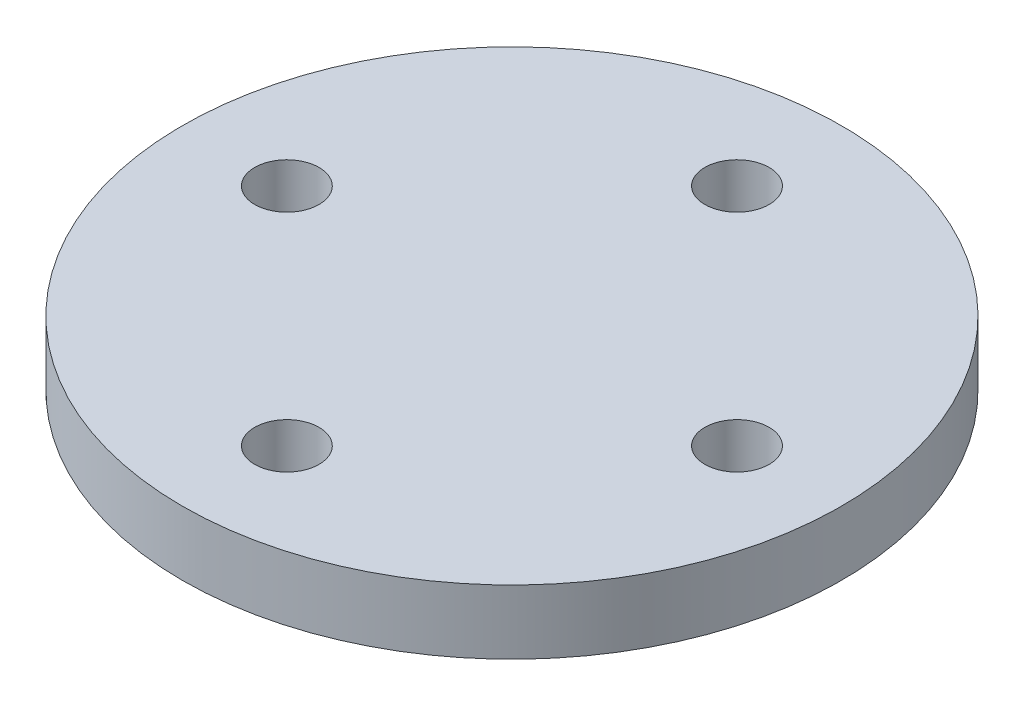
ISO-10303-21;
HEADER;
FILE_DESCRIPTION(('STEP AP214'),'2;1');
FILE_NAME('part.step','',(''),(''),'','','');
FILE_SCHEMA(('AUTOMOTIVE_DESIGN { 1 0 10303 214 1 1 1 1 }'));
ENDSEC;
DATA;
#1=APPLICATION_CONTEXT('core data for automotive mechanical design processes');
#2=APPLICATION_PROTOCOL_DEFINITION('international standard','automotive_design',2000,#1);
#3=PRODUCT_CONTEXT('',#1,'mechanical');
#4=PRODUCT('Part','Part','',(#3));
#5=PRODUCT_RELATED_PRODUCT_CATEGORY('part','',(#4));
#6=PRODUCT_DEFINITION_FORMATION('','',#4);
#7=PRODUCT_DEFINITION_CONTEXT('part definition',#1,'design');
#8=PRODUCT_DEFINITION('design','',#6,#7);
#9=PRODUCT_DEFINITION_SHAPE('','',#8);
#10=(LENGTH_UNIT() NAMED_UNIT(*) SI_UNIT(.MILLI.,.METRE.));
#11=(NAMED_UNIT(*) PLANE_ANGLE_UNIT() SI_UNIT($,.RADIAN.));
#12=(NAMED_UNIT(*) SI_UNIT($,.STERADIAN.) SOLID_ANGLE_UNIT());
#13=UNCERTAINTY_MEASURE_WITH_UNIT(LENGTH_MEASURE(1.E-05),#10,'distance_accuracy_value','');
#14=(GEOMETRIC_REPRESENTATION_CONTEXT(3) GLOBAL_UNCERTAINTY_ASSIGNED_CONTEXT((#13)) GLOBAL_UNIT_ASSIGNED_CONTEXT((#10,
#11,#12)) REPRESENTATION_CONTEXT('',''));
#15=CARTESIAN_POINT('',(0.,0.,0.));
#16=DIRECTION('',(0.,0.,1.));
#17=DIRECTION('',(1.,0.,0.));
#18=AXIS2_PLACEMENT_3D('',#15,#16,#17);
#19=CARTESIAN_POINT('',(0.,2.,0.));
#20=DIRECTION('',(0.,-1.,0.));
#21=DIRECTION('',(0.,0.,-1.));
#22=AXIS2_PLACEMENT_3D('',#19,#20,#21);
#23=CYLINDRICAL_SURFACE('',#22,10.25);
#24=CARTESIAN_POINT('',(0.,2.,0.));
#25=DIRECTION('',(0.,1.,0.));
#26=DIRECTION('',(0.,0.,1.));
#27=AXIS2_PLACEMENT_3D('',#24,#25,#26);
#28=CIRCLE('',#27,10.25);
#29=CARTESIAN_POINT('',(0.,2.,10.25));
#30=VERTEX_POINT('',#29);
#31=EDGE_CURVE('E41',#30,#30,#28,.T.);
#32=ORIENTED_EDGE('',*,*,#31,.F.);
#33=EDGE_LOOP('',(#32));
#34=FACE_BOUND('',#33,.T.);
#35=CARTESIAN_POINT('',(0.,0.,0.));
#36=DIRECTION('',(0.,1.,0.));
#37=DIRECTION('',(0.,0.,1.));
#38=AXIS2_PLACEMENT_3D('',#35,#36,#37);
#39=CIRCLE('',#38,10.25);
#40=CARTESIAN_POINT('',(0.,0.,10.25));
#41=VERTEX_POINT('',#40);
#42=EDGE_CURVE('E46',#41,#41,#39,.T.);
#43=ORIENTED_EDGE('',*,*,#42,.T.);
#44=EDGE_LOOP('',(#43));
#45=FACE_BOUND('',#44,.T.);
#46=ADVANCED_FACE('F34',(#34,#45),#23,.T.);
#47=CARTESIAN_POINT('',(0.,2.,0.));
#48=DIRECTION('',(0.,1.,0.));
#49=DIRECTION('',(0.,0.,1.));
#50=AXIS2_PLACEMENT_3D('',#47,#48,#49);
#51=PLANE('',#50);
#52=CARTESIAN_POINT('',(-7.,2.,0.));
#53=DIRECTION('',(0.,1.,0.));
#54=DIRECTION('',(0.,0.,1.));
#55=AXIS2_PLACEMENT_3D('',#52,#53,#54);
#56=CIRCLE('',#55,1.);
#57=CARTESIAN_POINT('',(-7.,2.,1.));
#58=VERTEX_POINT('',#57);
#59=EDGE_CURVE('E54',#58,#58,#56,.T.);
#60=ORIENTED_EDGE('',*,*,#59,.F.);
#61=EDGE_LOOP('',(#60));
#62=FACE_BOUND('',#61,.T.);
#63=CARTESIAN_POINT('',(0.,2.,-7.));
#64=DIRECTION('',(0.,1.,0.));
#65=DIRECTION('',(0.,0.,1.));
#66=AXIS2_PLACEMENT_3D('',#63,#64,#65);
#67=CIRCLE('',#66,1.);
#68=CARTESIAN_POINT('',(0.,2.,-6.));
#69=VERTEX_POINT('',#68);
#70=EDGE_CURVE('E81',#69,#69,#67,.T.);
#71=ORIENTED_EDGE('',*,*,#70,.F.);
#72=EDGE_LOOP('',(#71));
#73=FACE_BOUND('',#72,.T.);
#74=CARTESIAN_POINT('',(7.,2.,0.));
#75=DIRECTION('',(0.,1.,0.));
#76=DIRECTION('',(0.,0.,1.));
#77=AXIS2_PLACEMENT_3D('',#74,#75,#76);
#78=CIRCLE('',#77,1.);
#79=CARTESIAN_POINT('',(7.,2.,1.));
#80=VERTEX_POINT('',#79);
#81=EDGE_CURVE('E78',#80,#80,#78,.T.);
#82=ORIENTED_EDGE('',*,*,#81,.F.);
#83=EDGE_LOOP('',(#82));
#84=FACE_BOUND('',#83,.T.);
#85=CARTESIAN_POINT('',(0.,2.,7.));
#86=DIRECTION('',(0.,1.,0.));
#87=DIRECTION('',(0.,0.,1.));
#88=AXIS2_PLACEMENT_3D('',#85,#86,#87);
#89=CIRCLE('',#88,1.);
#90=CARTESIAN_POINT('',(0.,2.,8.));
#91=VERTEX_POINT('',#90);
#92=EDGE_CURVE('E75',#91,#91,#89,.T.);
#93=ORIENTED_EDGE('',*,*,#92,.F.);
#94=EDGE_LOOP('',(#93));
#95=FACE_BOUND('',#94,.T.);
#96=ORIENTED_EDGE('',*,*,#31,.T.);
#97=EDGE_LOOP('',(#96));
#98=FACE_BOUND('',#97,.T.);
#99=ADVANCED_FACE('F90',(#62,#73,#84,#95,#98),#51,.T.);
#100=CARTESIAN_POINT('',(0.,0.,0.));
#101=DIRECTION('',(0.,1.,0.));
#102=DIRECTION('',(0.,0.,1.));
#103=AXIS2_PLACEMENT_3D('',#100,#101,#102);
#104=PLANE('',#103);
#105=CARTESIAN_POINT('',(-7.,0.,0.));
#106=DIRECTION('',(0.,1.,0.));
#107=DIRECTION('',(0.,0.,1.));
#108=AXIS2_PLACEMENT_3D('',#105,#106,#107);
#109=CIRCLE('',#108,1.);
#110=CARTESIAN_POINT('',(-7.,0.,1.));
#111=VERTEX_POINT('',#110);
#112=EDGE_CURVE('E37',#111,#111,#109,.T.);
#113=ORIENTED_EDGE('',*,*,#112,.T.);
#114=EDGE_LOOP('',(#113));
#115=FACE_BOUND('',#114,.T.);
#116=CARTESIAN_POINT('',(0.,0.,-7.));
#117=DIRECTION('',(0.,1.,0.));
#118=DIRECTION('',(0.,0.,1.));
#119=AXIS2_PLACEMENT_3D('',#116,#117,#118);
#120=CIRCLE('',#119,1.);
#121=CARTESIAN_POINT('',(0.,0.,-6.));
#122=VERTEX_POINT('',#121);
#123=EDGE_CURVE('E56',#122,#122,#120,.T.);
#124=ORIENTED_EDGE('',*,*,#123,.T.);
#125=EDGE_LOOP('',(#124));
#126=FACE_BOUND('',#125,.T.);
#127=CARTESIAN_POINT('',(7.,0.,0.));
#128=DIRECTION('',(0.,1.,0.));
#129=DIRECTION('',(0.,0.,1.));
#130=AXIS2_PLACEMENT_3D('',#127,#128,#129);
#131=CIRCLE('',#130,1.);
#132=CARTESIAN_POINT('',(7.,0.,1.));
#133=VERTEX_POINT('',#132);
#134=EDGE_CURVE('E53',#133,#133,#131,.T.);
#135=ORIENTED_EDGE('',*,*,#134,.T.);
#136=EDGE_LOOP('',(#135));
#137=FACE_BOUND('',#136,.T.);
#138=CARTESIAN_POINT('',(0.,0.,7.));
#139=DIRECTION('',(0.,1.,0.));
#140=DIRECTION('',(0.,0.,1.));
#141=AXIS2_PLACEMENT_3D('',#138,#139,#140);
#142=CIRCLE('',#141,1.);
#143=CARTESIAN_POINT('',(0.,0.,8.));
#144=VERTEX_POINT('',#143);
#145=EDGE_CURVE('E50',#144,#144,#142,.T.);
#146=ORIENTED_EDGE('',*,*,#145,.T.);
#147=EDGE_LOOP('',(#146));
#148=FACE_BOUND('',#147,.T.);
#149=CARTESIAN_POINT('',(0.,0.,0.));
#150=DIRECTION('',(0.,1.,0.));
#151=DIRECTION('',(0.,0.,1.));
#152=AXIS2_PLACEMENT_3D('',#149,#150,#151);
#153=CIRCLE('',#152,4.);
#154=CARTESIAN_POINT('',(0.,0.,4.));
#155=VERTEX_POINT('',#154);
#156=EDGE_CURVE('E10',#155,#155,#153,.F.);
#157=ORIENTED_EDGE('',*,*,#156,.F.);
#158=EDGE_LOOP('',(#157));
#159=FACE_BOUND('',#158,.T.);
#160=ORIENTED_EDGE('',*,*,#42,.F.);
#161=EDGE_LOOP('',(#160));
#162=FACE_BOUND('',#161,.T.);
#163=ADVANCED_FACE('F93',(#115,#126,#137,#148,#159,#162),#104,.F.);
#164=CARTESIAN_POINT('',(0.,-3.,0.));
#165=DIRECTION('',(0.,1.,0.));
#166=DIRECTION('',(0.,0.,1.));
#167=AXIS2_PLACEMENT_3D('',#164,#165,#166);
#168=CYLINDRICAL_SURFACE('',#167,3.);
#169=CARTESIAN_POINT('',(0.,-3.,0.));
#170=DIRECTION('',(0.,-1.,0.));
#171=DIRECTION('',(0.,0.,-1.));
#172=AXIS2_PLACEMENT_3D('',#169,#170,#171);
#173=CIRCLE('',#172,3.);
#174=CARTESIAN_POINT('',(0.,-3.,-3.));
#175=VERTEX_POINT('',#174);
#176=EDGE_CURVE('E65',#175,#175,#173,.T.);
#177=ORIENTED_EDGE('',*,*,#176,.T.);
#178=EDGE_LOOP('',(#177));
#179=FACE_BOUND('',#178,.T.);
#180=CARTESIAN_POINT('',(0.,0.,0.));
#181=DIRECTION('',(0.,-1.,0.));
#182=DIRECTION('',(0.,0.,-1.));
#183=AXIS2_PLACEMENT_3D('',#180,#181,#182);
#184=CIRCLE('',#183,3.);
#185=CARTESIAN_POINT('',(0.,0.,-3.));
#186=VERTEX_POINT('',#185);
#187=EDGE_CURVE('E61',#186,#186,#184,.T.);
#188=ORIENTED_EDGE('',*,*,#187,.F.);
#189=EDGE_LOOP('',(#188));
#190=FACE_BOUND('',#189,.T.);
#191=ADVANCED_FACE('F109',(#179,#190),#168,.F.);
#192=CARTESIAN_POINT('',(0.,-3.,0.));
#193=DIRECTION('',(0.,1.,0.));
#194=DIRECTION('',(0.,0.,1.));
#195=AXIS2_PLACEMENT_3D('',#192,#193,#194);
#196=CYLINDRICAL_SURFACE('',#195,4.);
#197=CARTESIAN_POINT('',(0.,-3.,0.));
#198=DIRECTION('',(0.,-1.,0.));
#199=DIRECTION('',(0.,0.,-1.));
#200=AXIS2_PLACEMENT_3D('',#197,#198,#199);
#201=CIRCLE('',#200,4.);
#202=CARTESIAN_POINT('',(0.,-3.,-4.));
#203=VERTEX_POINT('',#202);
#204=EDGE_CURVE('E70',#203,#203,#201,.T.);
#205=ORIENTED_EDGE('',*,*,#204,.F.);
#206=EDGE_LOOP('',(#205));
#207=FACE_BOUND('',#206,.T.);
#208=ORIENTED_EDGE('',*,*,#156,.T.);
#209=EDGE_LOOP('',(#208));
#210=FACE_BOUND('',#209,.T.);
#211=ADVANCED_FACE('F114',(#207,#210),#196,.T.);
#212=CARTESIAN_POINT('',(0.,-3.,0.));
#213=DIRECTION('',(0.,-1.,0.));
#214=DIRECTION('',(0.,0.,-1.));
#215=AXIS2_PLACEMENT_3D('',#212,#213,#214);
#216=PLANE('',#215);
#217=ORIENTED_EDGE('',*,*,#176,.F.);
#218=EDGE_LOOP('',(#217));
#219=FACE_BOUND('',#218,.T.);
#220=ORIENTED_EDGE('',*,*,#204,.T.);
#221=EDGE_LOOP('',(#220));
#222=FACE_BOUND('',#221,.T.);
#223=ADVANCED_FACE('F119',(#219,#222),#216,.T.);
#224=ORIENTED_EDGE('',*,*,#187,.T.);
#225=EDGE_LOOP('',(#224));
#226=FACE_BOUND('',#225,.T.);
#227=ADVANCED_FACE('F110',(#226),#104,.F.);
#228=CARTESIAN_POINT('',(0.,-1.,7.));
#229=DIRECTION('',(0.,1.,0.));
#230=DIRECTION('',(0.,0.,1.));
#231=AXIS2_PLACEMENT_3D('',#228,#229,#230);
#232=CYLINDRICAL_SURFACE('',#231,1.);
#233=ORIENTED_EDGE('',*,*,#92,.T.);
#234=EDGE_LOOP('',(#233));
#235=FACE_BOUND('',#234,.T.);
#236=ORIENTED_EDGE('',*,*,#145,.F.);
#237=EDGE_LOOP('',(#236));
#238=FACE_BOUND('',#237,.T.);
#239=ADVANCED_FACE('F118',(#235,#238),#232,.F.);
#240=CARTESIAN_POINT('',(7.,-1.,0.));
#241=DIRECTION('',(0.,1.,0.));
#242=DIRECTION('',(0.,0.,1.));
#243=AXIS2_PLACEMENT_3D('',#240,#241,#242);
#244=CYLINDRICAL_SURFACE('',#243,1.);
#245=ORIENTED_EDGE('',*,*,#81,.T.);
#246=EDGE_LOOP('',(#245));
#247=FACE_BOUND('',#246,.T.);
#248=ORIENTED_EDGE('',*,*,#134,.F.);
#249=EDGE_LOOP('',(#248));
#250=FACE_BOUND('',#249,.T.);
#251=ADVANCED_FACE('F124',(#247,#250),#244,.F.);
#252=CARTESIAN_POINT('',(0.,-1.,-7.));
#253=DIRECTION('',(0.,1.,0.));
#254=DIRECTION('',(0.,0.,1.));
#255=AXIS2_PLACEMENT_3D('',#252,#253,#254);
#256=CYLINDRICAL_SURFACE('',#255,1.);
#257=ORIENTED_EDGE('',*,*,#70,.T.);
#258=EDGE_LOOP('',(#257));
#259=FACE_BOUND('',#258,.T.);
#260=ORIENTED_EDGE('',*,*,#123,.F.);
#261=EDGE_LOOP('',(#260));
#262=FACE_BOUND('',#261,.T.);
#263=ADVANCED_FACE('F139',(#259,#262),#256,.F.);
#264=CARTESIAN_POINT('',(-7.,-1.,0.));
#265=DIRECTION('',(0.,1.,0.));
#266=DIRECTION('',(0.,0.,1.));
#267=AXIS2_PLACEMENT_3D('',#264,#265,#266);
#268=CYLINDRICAL_SURFACE('',#267,1.);
#269=ORIENTED_EDGE('',*,*,#59,.T.);
#270=EDGE_LOOP('',(#269));
#271=FACE_BOUND('',#270,.T.);
#272=ORIENTED_EDGE('',*,*,#112,.F.);
#273=EDGE_LOOP('',(#272));
#274=FACE_BOUND('',#273,.T.);
#275=ADVANCED_FACE('F87',(#271,#274),#268,.F.);
#276=CLOSED_SHELL('',(#46,#99,#163,#191,#211,#223,#227,#239,#251,#263,#275));
#277=MANIFOLD_SOLID_BREP('B2',#276);
#278=ADVANCED_BREP_SHAPE_REPRESENTATION('',(#18,#277),#14);
#279=SHAPE_DEFINITION_REPRESENTATION(#9,#278);
ENDSEC;
END-ISO-10303-21;
